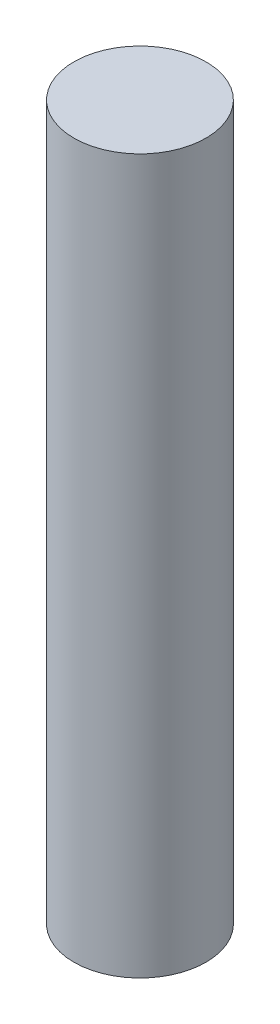
ISO-10303-21;
HEADER;
FILE_DESCRIPTION(('STEP AP214'),'2;1');
FILE_NAME('part.step','',(''),(''),'','','');
FILE_SCHEMA(('AUTOMOTIVE_DESIGN { 1 0 10303 214 1 1 1 1 }'));
ENDSEC;
DATA;
#1=APPLICATION_CONTEXT('core data for automotive mechanical design processes');
#2=APPLICATION_PROTOCOL_DEFINITION('international standard','automotive_design',2000,#1);
#3=PRODUCT_CONTEXT('',#1,'mechanical');
#4=PRODUCT('Part','Part','',(#3));
#5=PRODUCT_RELATED_PRODUCT_CATEGORY('part','',(#4));
#6=PRODUCT_DEFINITION_FORMATION('','',#4);
#7=PRODUCT_DEFINITION_CONTEXT('part definition',#1,'design');
#8=PRODUCT_DEFINITION('design','',#6,#7);
#9=PRODUCT_DEFINITION_SHAPE('','',#8);
#10=(LENGTH_UNIT() NAMED_UNIT(*) SI_UNIT(.MILLI.,.METRE.));
#11=(NAMED_UNIT(*) PLANE_ANGLE_UNIT() SI_UNIT($,.RADIAN.));
#12=(NAMED_UNIT(*) SI_UNIT($,.STERADIAN.) SOLID_ANGLE_UNIT());
#13=UNCERTAINTY_MEASURE_WITH_UNIT(LENGTH_MEASURE(1.E-05),#10,'distance_accuracy_value','');
#14=(GEOMETRIC_REPRESENTATION_CONTEXT(3) GLOBAL_UNCERTAINTY_ASSIGNED_CONTEXT((#13)) GLOBAL_UNIT_ASSIGNED_CONTEXT((#10,
#11,#12)) REPRESENTATION_CONTEXT('',''));
#15=CARTESIAN_POINT('',(0.,0.,0.));
#16=DIRECTION('',(0.,0.,1.));
#17=DIRECTION('',(1.,0.,0.));
#18=AXIS2_PLACEMENT_3D('',#15,#16,#17);
#19=CARTESIAN_POINT('',(0.,13.5,0.));
#20=DIRECTION('',(0.,-1.,0.));
#21=DIRECTION('',(0.,0.,-1.));
#22=AXIS2_PLACEMENT_3D('',#19,#20,#21);
#23=CYLINDRICAL_SURFACE('',#22,2.5);
#24=CARTESIAN_POINT('',(0.,13.5,0.));
#25=DIRECTION('',(0.,1.,0.));
#26=DIRECTION('',(0.,0.,1.));
#27=AXIS2_PLACEMENT_3D('',#24,#25,#26);
#28=CIRCLE('',#27,2.5);
#29=CARTESIAN_POINT('',(0.,13.5,2.5));
#30=VERTEX_POINT('',#29);
#31=EDGE_CURVE('E10',#30,#30,#28,.T.);
#32=ORIENTED_EDGE('',*,*,#31,.F.);
#33=EDGE_LOOP('',(#32));
#34=FACE_BOUND('',#33,.T.);
#35=CARTESIAN_POINT('',(0.,-13.5,0.));
#36=DIRECTION('',(0.,1.,0.));
#37=DIRECTION('',(0.,0.,1.));
#38=AXIS2_PLACEMENT_3D('',#35,#36,#37);
#39=CIRCLE('',#38,2.5);
#40=CARTESIAN_POINT('',(0.,-13.5,2.5));
#41=VERTEX_POINT('',#40);
#42=EDGE_CURVE('E43',#41,#41,#39,.T.);
#43=ORIENTED_EDGE('',*,*,#42,.T.);
#44=EDGE_LOOP('',(#43));
#45=FACE_BOUND('',#44,.T.);
#46=ADVANCED_FACE('F40',(#34,#45),#23,.T.);
#47=CARTESIAN_POINT('',(0.,13.5,0.));
#48=DIRECTION('',(0.,1.,0.));
#49=DIRECTION('',(0.,0.,1.));
#50=AXIS2_PLACEMENT_3D('',#47,#48,#49);
#51=PLANE('',#50);
#52=ORIENTED_EDGE('',*,*,#31,.T.);
#53=EDGE_LOOP('',(#52));
#54=FACE_BOUND('',#53,.T.);
#55=ADVANCED_FACE('F55',(#54),#51,.T.);
#56=CARTESIAN_POINT('',(0.,-13.5,0.));
#57=DIRECTION('',(0.,1.,0.));
#58=DIRECTION('',(0.,0.,1.));
#59=AXIS2_PLACEMENT_3D('',#56,#57,#58);
#60=PLANE('',#59);
#61=ORIENTED_EDGE('',*,*,#42,.F.);
#62=EDGE_LOOP('',(#61));
#63=FACE_BOUND('',#62,.T.);
#64=ADVANCED_FACE('F53',(#63),#60,.F.);
#65=CLOSED_SHELL('',(#46,#55,#64));
#66=MANIFOLD_SOLID_BREP('B2',#65);
#67=ADVANCED_BREP_SHAPE_REPRESENTATION('',(#18,#66),#14);
#68=SHAPE_DEFINITION_REPRESENTATION(#9,#67);
ENDSEC;
END-ISO-10303-21;
